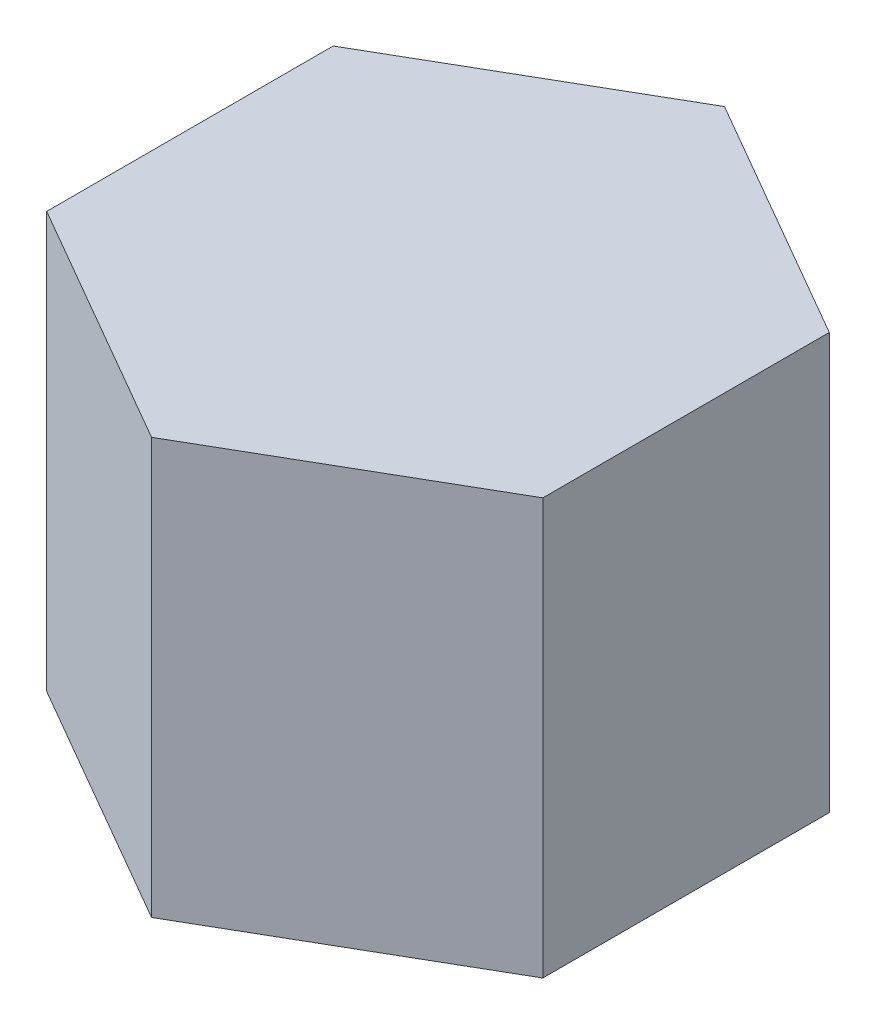
ISO-10303-21;
HEADER;
FILE_DESCRIPTION(('STEP AP214'),'2;1');
FILE_NAME('part.step','',(''),(''),'','','');
FILE_SCHEMA(('AUTOMOTIVE_DESIGN { 1 0 10303 214 1 1 1 1 }'));
ENDSEC;
DATA;
#1=APPLICATION_CONTEXT('core data for automotive mechanical design processes');
#2=APPLICATION_PROTOCOL_DEFINITION('international standard','automotive_design',2000,#1);
#3=PRODUCT_CONTEXT('',#1,'mechanical');
#4=PRODUCT('Part','Part','',(#3));
#5=PRODUCT_RELATED_PRODUCT_CATEGORY('part','',(#4));
#6=PRODUCT_DEFINITION_FORMATION('','',#4);
#7=PRODUCT_DEFINITION_CONTEXT('part definition',#1,'design');
#8=PRODUCT_DEFINITION('design','',#6,#7);
#9=PRODUCT_DEFINITION_SHAPE('','',#8);
#10=(LENGTH_UNIT() NAMED_UNIT(*) SI_UNIT(.MILLI.,.METRE.));
#11=(NAMED_UNIT(*) PLANE_ANGLE_UNIT() SI_UNIT($,.RADIAN.));
#12=(NAMED_UNIT(*) SI_UNIT($,.STERADIAN.) SOLID_ANGLE_UNIT());
#13=UNCERTAINTY_MEASURE_WITH_UNIT(LENGTH_MEASURE(1.E-05),#10,'distance_accuracy_value','');
#14=(GEOMETRIC_REPRESENTATION_CONTEXT(3) GLOBAL_UNCERTAINTY_ASSIGNED_CONTEXT((#13)) GLOBAL_UNIT_ASSIGNED_CONTEXT((#10,
#11,#12)) REPRESENTATION_CONTEXT('',''));
#15=CARTESIAN_POINT('',(0.,0.,0.));
#16=DIRECTION('',(0.,0.,1.));
#17=DIRECTION('',(1.,0.,0.));
#18=AXIS2_PLACEMENT_3D('',#15,#16,#17);
#19=CARTESIAN_POINT('',(202.642660308706,-148.537700895744,291.506971220494));
#20=DIRECTION('',(-0.499999999999909,0.,-0.866025403784491));
#21=DIRECTION('',(-0.866025403784491,0.,0.499999999999909));
#22=AXIS2_PLACEMENT_3D('',#19,#20,#21);
#23=PLANE('',#22);
#24=CARTESIAN_POINT('',(202.339551417382,-149.045793579175,291.681971220494));
#25=DIRECTION('',(0.866025403784491,0.,-0.499999999999909));
#26=VECTOR('',#25,1.);
#27=LINE('',#24,#26);
#28=CARTESIAN_POINT('',(202.339551417382,-149.045793579175,291.681971220494));
#29=VERTEX_POINT('',#28);
#30=CARTESIAN_POINT('',(202.642660308706,-149.045793579175,291.506971220494));
#31=VERTEX_POINT('',#30);
#32=EDGE_CURVE('E170',#29,#31,#27,.T.);
#33=ORIENTED_EDGE('',*,*,#32,.T.);
#34=CARTESIAN_POINT('',(202.642660308706,-148.537700895744,291.506971220494));
#35=DIRECTION('',(0.,-1.,0.));
#36=VECTOR('',#35,1.);
#37=LINE('',#34,#36);
#38=CARTESIAN_POINT('',(202.642660308706,-148.537700895744,291.506971220494));
#39=VERTEX_POINT('',#38);
#40=EDGE_CURVE('E35',#39,#31,#37,.T.);
#41=ORIENTED_EDGE('',*,*,#40,.F.);
#42=CARTESIAN_POINT('',(202.339551417382,-148.537700895744,291.681971220494));
#43=DIRECTION('',(0.866025403784491,0.,-0.499999999999909));
#44=VECTOR('',#43,1.);
#45=LINE('',#42,#44);
#46=CARTESIAN_POINT('',(202.339551417382,-148.537700895744,291.681971220494));
#47=VERTEX_POINT('',#46);
#48=EDGE_CURVE('E159',#47,#39,#45,.T.);
#49=ORIENTED_EDGE('',*,*,#48,.F.);
#50=CARTESIAN_POINT('',(202.339551417382,-148.537700895744,291.681971220494));
#51=DIRECTION('',(0.,-1.,0.));
#52=VECTOR('',#51,1.);
#53=LINE('',#50,#52);
#54=EDGE_CURVE('E10',#47,#29,#53,.T.);
#55=ORIENTED_EDGE('',*,*,#54,.T.);
#56=EDGE_LOOP('',(#33,#41,#49,#55));
#57=FACE_BOUND('',#56,.T.);
#58=ADVANCED_FACE('F16',(#57),#23,.F.);
#59=CARTESIAN_POINT('',(202.339551417382,-148.537700895744,291.681971220494));
#60=DIRECTION('',(0.499999999999978,0.,-0.866025403784452));
#61=DIRECTION('',(-0.866025403784452,0.,-0.499999999999978));
#62=AXIS2_PLACEMENT_3D('',#59,#60,#61);
#63=PLANE('',#62);
#64=CARTESIAN_POINT('',(202.036442526057,-149.045793579175,291.506971220494));
#65=DIRECTION('',(0.866025403784452,0.,0.499999999999978));
#66=VECTOR('',#65,1.);
#67=LINE('',#64,#66);
#68=CARTESIAN_POINT('',(202.036442526057,-149.045793579175,291.506971220494));
#69=VERTEX_POINT('',#68);
#70=EDGE_CURVE('E167',#69,#29,#67,.T.);
#71=ORIENTED_EDGE('',*,*,#70,.T.);
#72=ORIENTED_EDGE('',*,*,#54,.F.);
#73=CARTESIAN_POINT('',(202.036442526057,-148.537700895744,291.506971220494));
#74=DIRECTION('',(0.866025403784452,0.,0.499999999999978));
#75=VECTOR('',#74,1.);
#76=LINE('',#73,#75);
#77=CARTESIAN_POINT('',(202.036442526057,-148.537700895744,291.506971220494));
#78=VERTEX_POINT('',#77);
#79=EDGE_CURVE('E156',#78,#47,#76,.T.);
#80=ORIENTED_EDGE('',*,*,#79,.F.);
#81=CARTESIAN_POINT('',(202.036442526057,-148.537700895744,291.506971220494));
#82=DIRECTION('',(0.,-1.,0.));
#83=VECTOR('',#82,1.);
#84=LINE('',#81,#83);
#85=EDGE_CURVE('E27',#78,#69,#84,.T.);
#86=ORIENTED_EDGE('',*,*,#85,.T.);
#87=EDGE_LOOP('',(#71,#72,#80,#86));
#88=FACE_BOUND('',#87,.T.);
#89=ADVANCED_FACE('F189',(#88),#63,.F.);
#90=CARTESIAN_POINT('',(202.036442526057,-148.537700895744,290.831971220494));
#91=DIRECTION('',(1.,0.,0.));
#92=DIRECTION('',(0.,1.,0.));
#93=AXIS2_PLACEMENT_3D('',#90,#91,#92);
#94=PLANE('',#93);
#95=CARTESIAN_POINT('',(202.036442526057,-149.045793579175,291.156971220494));
#96=DIRECTION('',(0.,0.,1.));
#97=VECTOR('',#96,1.);
#98=LINE('',#95,#97);
#99=CARTESIAN_POINT('',(202.036442526057,-149.045793579175,291.156971220494));
#100=VERTEX_POINT('',#99);
#101=EDGE_CURVE('E163',#100,#69,#98,.T.);
#102=ORIENTED_EDGE('',*,*,#101,.T.);
#103=ORIENTED_EDGE('',*,*,#85,.F.);
#104=CARTESIAN_POINT('',(202.036442526057,-148.537700895744,291.156971220494));
#105=DIRECTION('',(0.,0.,1.));
#106=VECTOR('',#105,1.);
#107=LINE('',#104,#106);
#108=CARTESIAN_POINT('',(202.036442526057,-148.537700895744,291.156971220494));
#109=VERTEX_POINT('',#108);
#110=EDGE_CURVE('E106',#109,#78,#107,.T.);
#111=ORIENTED_EDGE('',*,*,#110,.F.);
#112=CARTESIAN_POINT('',(202.036442526057,-148.537700895744,291.156971220494));
#113=DIRECTION('',(0.,-1.,0.));
#114=VECTOR('',#113,1.);
#115=LINE('',#112,#114);
#116=EDGE_CURVE('E94',#109,#100,#115,.T.);
#117=ORIENTED_EDGE('',*,*,#116,.T.);
#118=EDGE_LOOP('',(#102,#103,#111,#117));
#119=FACE_BOUND('',#118,.T.);
#120=ADVANCED_FACE('F198',(#119),#94,.F.);
#121=CARTESIAN_POINT('',(202.036442526057,-148.537700895744,291.156971220494));
#122=DIRECTION('',(0.499999999999943,0.,0.866025403784472));
#123=DIRECTION('',(0.866025403784472,0.,-0.499999999999943));
#124=AXIS2_PLACEMENT_3D('',#121,#122,#123);
#125=PLANE('',#124);
#126=CARTESIAN_POINT('',(202.339551417382,-149.045793579175,290.981971220494));
#127=DIRECTION('',(-0.866025403784471,0.,0.499999999999943));
#128=VECTOR('',#127,1.);
#129=LINE('',#126,#128);
#130=CARTESIAN_POINT('',(202.339551417382,-149.045793579175,290.981971220494));
#131=VERTEX_POINT('',#130);
#132=EDGE_CURVE('E162',#131,#100,#129,.T.);
#133=ORIENTED_EDGE('',*,*,#132,.T.);
#134=ORIENTED_EDGE('',*,*,#116,.F.);
#135=CARTESIAN_POINT('',(202.339551417382,-148.537700895744,290.981971220494));
#136=DIRECTION('',(-0.866025403784471,0.,0.499999999999943));
#137=VECTOR('',#136,1.);
#138=LINE('',#135,#137);
#139=CARTESIAN_POINT('',(202.339551417382,-148.537700895744,290.981971220494));
#140=VERTEX_POINT('',#139);
#141=EDGE_CURVE('E98',#140,#109,#138,.T.);
#142=ORIENTED_EDGE('',*,*,#141,.F.);
#143=CARTESIAN_POINT('',(202.339551417382,-148.537700895744,290.981971220494));
#144=DIRECTION('',(0.,-1.,0.));
#145=VECTOR('',#144,1.);
#146=LINE('',#143,#145);
#147=EDGE_CURVE('E79',#140,#131,#146,.T.);
#148=ORIENTED_EDGE('',*,*,#147,.T.);
#149=EDGE_LOOP('',(#133,#134,#142,#148));
#150=FACE_BOUND('',#149,.T.);
#151=ADVANCED_FACE('F100',(#150),#125,.F.);
#152=CARTESIAN_POINT('',(202.339551417381,-148.537700895744,290.981971220494));
#153=DIRECTION('',(-0.500000000000028,0.,0.866025403784423));
#154=DIRECTION('',(0.866025403784423,0.,0.500000000000028));
#155=AXIS2_PLACEMENT_3D('',#152,#153,#154);
#156=PLANE('',#155);
#157=CARTESIAN_POINT('',(202.642660308706,-149.045793579175,291.156971220494));
#158=DIRECTION('',(-0.866025403784422,0.,-0.500000000000028));
#159=VECTOR('',#158,1.);
#160=LINE('',#157,#159);
#161=CARTESIAN_POINT('',(202.642660308706,-149.045793579175,291.156971220494));
#162=VERTEX_POINT('',#161);
#163=EDGE_CURVE('E88',#162,#131,#160,.T.);
#164=ORIENTED_EDGE('',*,*,#163,.T.);
#165=ORIENTED_EDGE('',*,*,#147,.F.);
#166=CARTESIAN_POINT('',(202.642660308706,-148.537700895744,291.156971220494));
#167=DIRECTION('',(-0.866025403784422,0.,-0.500000000000028));
#168=VECTOR('',#167,1.);
#169=LINE('',#166,#168);
#170=CARTESIAN_POINT('',(202.642660308706,-148.537700895744,291.156971220494));
#171=VERTEX_POINT('',#170);
#172=EDGE_CURVE('E84',#171,#140,#169,.T.);
#173=ORIENTED_EDGE('',*,*,#172,.F.);
#174=CARTESIAN_POINT('',(202.642660308706,-148.537700895744,291.156971220494));
#175=DIRECTION('',(0.,-1.,0.));
#176=VECTOR('',#175,1.);
#177=LINE('',#174,#176);
#178=EDGE_CURVE('E58',#171,#162,#177,.T.);
#179=ORIENTED_EDGE('',*,*,#178,.T.);
#180=EDGE_LOOP('',(#164,#165,#173,#179));
#181=FACE_BOUND('',#180,.T.);
#182=ADVANCED_FACE('F82',(#181),#156,.F.);
#183=CARTESIAN_POINT('',(202.642660308706,-148.537700895744,290.831971220494));
#184=DIRECTION('',(-1.,0.,0.));
#185=DIRECTION('',(0.,-1.,0.));
#186=AXIS2_PLACEMENT_3D('',#183,#184,#185);
#187=PLANE('',#186);
#188=CARTESIAN_POINT('',(202.642660308706,-149.045793579175,291.506971220494));
#189=DIRECTION('',(0.,0.,-1.));
#190=VECTOR('',#189,1.);
#191=LINE('',#188,#190);
#192=EDGE_CURVE('E160',#31,#162,#191,.T.);
#193=ORIENTED_EDGE('',*,*,#192,.T.);
#194=ORIENTED_EDGE('',*,*,#178,.F.);
#195=CARTESIAN_POINT('',(202.642660308706,-148.537700895744,291.506971220494));
#196=DIRECTION('',(0.,0.,-1.));
#197=VECTOR('',#196,1.);
#198=LINE('',#195,#197);
#199=EDGE_CURVE('E112',#39,#171,#198,.T.);
#200=ORIENTED_EDGE('',*,*,#199,.F.);
#201=ORIENTED_EDGE('',*,*,#40,.T.);
#202=EDGE_LOOP('',(#193,#194,#200,#201));
#203=FACE_BOUND('',#202,.T.);
#204=ADVANCED_FACE('F131',(#203),#187,.F.);
#205=CARTESIAN_POINT('',(206.339551417382,-148.537700895744,290.831971220494));
#206=DIRECTION('',(0.,-1.,0.));
#207=DIRECTION('',(1.,0.,0.));
#208=AXIS2_PLACEMENT_3D('',#205,#206,#207);
#209=PLANE('',#208);
#210=ORIENTED_EDGE('',*,*,#48,.T.);
#211=ORIENTED_EDGE('',*,*,#199,.T.);
#212=ORIENTED_EDGE('',*,*,#172,.T.);
#213=ORIENTED_EDGE('',*,*,#141,.T.);
#214=ORIENTED_EDGE('',*,*,#110,.T.);
#215=ORIENTED_EDGE('',*,*,#79,.T.);
#216=EDGE_LOOP('',(#210,#211,#212,#213,#214,#215));
#217=FACE_BOUND('',#216,.T.);
#218=ADVANCED_FACE('F111',(#217),#209,.F.);
#219=CARTESIAN_POINT('',(206.339551417382,-149.045793579175,290.831971220494));
#220=DIRECTION('',(0.,-1.,0.));
#221=DIRECTION('',(1.,0.,0.));
#222=AXIS2_PLACEMENT_3D('',#219,#220,#221);
#223=PLANE('',#222);
#224=ORIENTED_EDGE('',*,*,#32,.F.);
#225=ORIENTED_EDGE('',*,*,#70,.F.);
#226=ORIENTED_EDGE('',*,*,#101,.F.);
#227=ORIENTED_EDGE('',*,*,#132,.F.);
#228=ORIENTED_EDGE('',*,*,#163,.F.);
#229=ORIENTED_EDGE('',*,*,#192,.F.);
#230=EDGE_LOOP('',(#224,#225,#226,#227,#228,#229));
#231=FACE_BOUND('',#230,.T.);
#232=ADVANCED_FACE('F130',(#231),#223,.T.);
#233=CLOSED_SHELL('',(#58,#89,#120,#151,#182,#204,#218,#232));
#234=MANIFOLD_SOLID_BREP('B1',#233);
#235=ADVANCED_BREP_SHAPE_REPRESENTATION('',(#18,#234),#14);
#236=SHAPE_DEFINITION_REPRESENTATION(#9,#235);
ENDSEC;
END-ISO-10303-21;
